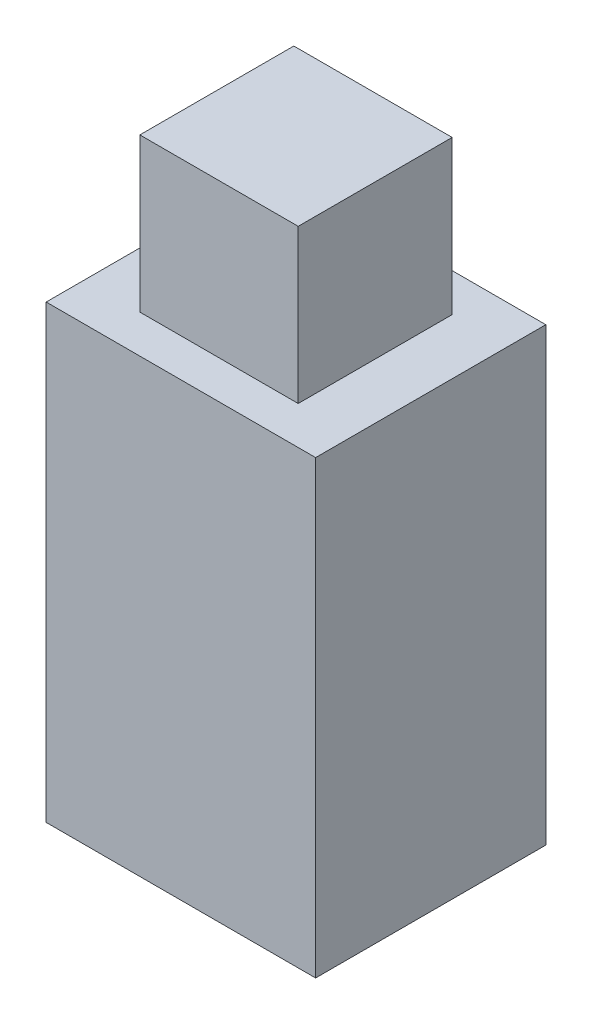
ISO-10303-21;
HEADER;
FILE_DESCRIPTION(('STEP AP214'),'2;1');
FILE_NAME('part.step','',(''),(''),'','','');
FILE_SCHEMA(('AUTOMOTIVE_DESIGN { 1 0 10303 214 1 1 1 1 }'));
ENDSEC;
DATA;
#1=APPLICATION_CONTEXT('core data for automotive mechanical design processes');
#2=APPLICATION_PROTOCOL_DEFINITION('international standard','automotive_design',2000,#1);
#3=PRODUCT_CONTEXT('',#1,'mechanical');
#4=PRODUCT('Part','Part','',(#3));
#5=PRODUCT_RELATED_PRODUCT_CATEGORY('part','',(#4));
#6=PRODUCT_DEFINITION_FORMATION('','',#4);
#7=PRODUCT_DEFINITION_CONTEXT('part definition',#1,'design');
#8=PRODUCT_DEFINITION('design','',#6,#7);
#9=PRODUCT_DEFINITION_SHAPE('','',#8);
#10=(LENGTH_UNIT() NAMED_UNIT(*) SI_UNIT(.MILLI.,.METRE.));
#11=(NAMED_UNIT(*) PLANE_ANGLE_UNIT() SI_UNIT($,.RADIAN.));
#12=(NAMED_UNIT(*) SI_UNIT($,.STERADIAN.) SOLID_ANGLE_UNIT());
#13=UNCERTAINTY_MEASURE_WITH_UNIT(LENGTH_MEASURE(1.E-05),#10,'distance_accuracy_value','');
#14=(GEOMETRIC_REPRESENTATION_CONTEXT(3) GLOBAL_UNCERTAINTY_ASSIGNED_CONTEXT((#13)) GLOBAL_UNIT_ASSIGNED_CONTEXT((#10,
#11,#12)) REPRESENTATION_CONTEXT('',''));
#15=CARTESIAN_POINT('',(0.,0.,0.));
#16=DIRECTION('',(0.,0.,1.));
#17=DIRECTION('',(1.,0.,0.));
#18=AXIS2_PLACEMENT_3D('',#15,#16,#17);
#19=CARTESIAN_POINT('',(-51.5518004325486,45.6166880918545,60.));
#20=DIRECTION('',(0.,-1.,0.));
#21=DIRECTION('',(0.,0.,-1.));
#22=AXIS2_PLACEMENT_3D('',#19,#20,#21);
#23=PLANE('',#22);
#24=DIRECTION('',(-1.,0.,0.));
#25=VECTOR('',#24,1.);
#26=CARTESIAN_POINT('',(-51.5518004325486,45.6166880918545,0.));
#27=LINE('',#26,#25);
#28=CARTESIAN_POINT('',(18.6789460491354,45.6166880918545,0.));
#29=VERTEX_POINT('',#28);
#30=CARTESIAN_POINT('',(-51.5518004325486,45.6166880918545,0.));
#31=VERTEX_POINT('',#30);
#32=EDGE_CURVE('E121',#29,#31,#27,.T.);
#33=ORIENTED_EDGE('',*,*,#32,.T.);
#34=DIRECTION('',(0.,0.,-1.));
#35=VECTOR('',#34,1.);
#36=CARTESIAN_POINT('',(-51.5518004325486,45.6166880918545,60.));
#37=LINE('',#36,#35);
#38=CARTESIAN_POINT('',(-51.5518004325486,45.6166880918545,60.));
#39=VERTEX_POINT('',#38);
#40=EDGE_CURVE('E41',#39,#31,#37,.T.);
#41=ORIENTED_EDGE('',*,*,#40,.F.);
#42=DIRECTION('',(-1.,0.,0.));
#43=VECTOR('',#42,1.);
#44=CARTESIAN_POINT('',(-51.5518004325486,45.6166880918545,60.));
#45=LINE('',#44,#43);
#46=CARTESIAN_POINT('',(18.6789460491354,45.6166880918545,60.));
#47=VERTEX_POINT('',#46);
#48=EDGE_CURVE('E130',#47,#39,#45,.T.);
#49=ORIENTED_EDGE('',*,*,#48,.F.);
#50=DIRECTION('',(0.,0.,-1.));
#51=VECTOR('',#50,1.);
#52=CARTESIAN_POINT('',(18.6789460491354,45.6166880918545,60.));
#53=LINE('',#52,#51);
#54=EDGE_CURVE('E11',#47,#29,#53,.T.);
#55=ORIENTED_EDGE('',*,*,#54,.T.);
#56=EDGE_LOOP('',(#33,#41,#49,#55));
#57=FACE_BOUND('',#56,.T.);
#58=DIRECTION('',(0.,0.,1.));
#59=VECTOR('',#58,1.);
#60=CARTESIAN_POINT('',(-37.072848430455,45.6166880918545,50.0657033429638));
#61=LINE('',#60,#59);
#62=CARTESIAN_POINT('',(-37.072848430455,45.6166880918545,9.93429665703616));
#63=VERTEX_POINT('',#62);
#64=CARTESIAN_POINT('',(-37.072848430455,45.6166880918545,50.0657033429638));
#65=VERTEX_POINT('',#64);
#66=EDGE_CURVE('E48',#63,#65,#61,.T.);
#67=ORIENTED_EDGE('',*,*,#66,.F.);
#68=DIRECTION('',(-1.,0.,0.));
#69=VECTOR('',#68,1.);
#70=CARTESIAN_POINT('',(4.19999404704186,45.6166880918545,9.93429665703616));
#71=LINE('',#70,#69);
#72=CARTESIAN_POINT('',(4.19999404704186,45.6166880918545,9.93429665703616));
#73=VERTEX_POINT('',#72);
#74=EDGE_CURVE('E52',#73,#63,#71,.T.);
#75=ORIENTED_EDGE('',*,*,#74,.F.);
#76=DIRECTION('',(0.,0.,-1.));
#77=VECTOR('',#76,1.);
#78=CARTESIAN_POINT('',(4.19999404704186,45.6166880918545,50.0657033429638));
#79=LINE('',#78,#77);
#80=CARTESIAN_POINT('',(4.19999404704186,45.6166880918545,50.0657033429638));
#81=VERTEX_POINT('',#80);
#82=EDGE_CURVE('E260',#81,#73,#79,.T.);
#83=ORIENTED_EDGE('',*,*,#82,.F.);
#84=DIRECTION('',(1.,0.,0.));
#85=VECTOR('',#84,1.);
#86=CARTESIAN_POINT('',(4.19999404704186,45.6166880918545,50.0657033429638));
#87=LINE('',#86,#85);
#88=EDGE_CURVE('E266',#65,#81,#87,.T.);
#89=ORIENTED_EDGE('',*,*,#88,.F.);
#90=EDGE_LOOP('',(#67,#75,#83,#89));
#91=FACE_BOUND('',#90,.T.);
#92=ADVANCED_FACE('F33',(#57,#91),#23,.F.);
#93=CARTESIAN_POINT('',(18.6789460491354,-71.8594149399223,60.));
#94=DIRECTION('',(-1.,0.,0.));
#95=DIRECTION('',(0.,0.,1.));
#96=AXIS2_PLACEMENT_3D('',#93,#94,#95);
#97=PLANE('',#96);
#98=DIRECTION('',(0.,1.,0.));
#99=VECTOR('',#98,1.);
#100=CARTESIAN_POINT('',(18.6789460491354,-71.8594149399223,0.));
#101=LINE('',#100,#99);
#102=CARTESIAN_POINT('',(18.6789460491354,-71.8594149399223,0.));
#103=VERTEX_POINT('',#102);
#104=EDGE_CURVE('E118',#103,#29,#101,.T.);
#105=ORIENTED_EDGE('',*,*,#104,.T.);
#106=ORIENTED_EDGE('',*,*,#54,.F.);
#107=DIRECTION('',(0.,1.,0.));
#108=VECTOR('',#107,1.);
#109=CARTESIAN_POINT('',(18.6789460491354,-71.8594149399223,60.));
#110=LINE('',#109,#108);
#111=CARTESIAN_POINT('',(18.6789460491354,-71.8594149399223,60.));
#112=VERTEX_POINT('',#111);
#113=EDGE_CURVE('E127',#112,#47,#110,.T.);
#114=ORIENTED_EDGE('',*,*,#113,.F.);
#115=DIRECTION('',(0.,0.,-1.));
#116=VECTOR('',#115,1.);
#117=CARTESIAN_POINT('',(18.6789460491354,-71.8594149399223,60.));
#118=LINE('',#117,#116);
#119=EDGE_CURVE('E136',#112,#103,#118,.T.);
#120=ORIENTED_EDGE('',*,*,#119,.T.);
#121=EDGE_LOOP('',(#105,#106,#114,#120));
#122=FACE_BOUND('',#121,.T.);
#123=ADVANCED_FACE('F35',(#122),#97,.F.);
#124=CARTESIAN_POINT('',(-51.5518004325486,-71.8594149399223,60.));
#125=DIRECTION('',(1.,0.,0.));
#126=DIRECTION('',(0.,0.,-1.));
#127=AXIS2_PLACEMENT_3D('',#124,#125,#126);
#128=PLANE('',#127);
#129=DIRECTION('',(0.,-1.,0.));
#130=VECTOR('',#129,1.);
#131=CARTESIAN_POINT('',(-51.5518004325486,-71.8594149399223,0.));
#132=LINE('',#131,#130);
#133=CARTESIAN_POINT('',(-51.5518004325486,-71.8594149399223,0.));
#134=VERTEX_POINT('',#133);
#135=EDGE_CURVE('E139',#31,#134,#132,.T.);
#136=ORIENTED_EDGE('',*,*,#135,.T.);
#137=DIRECTION('',(0.,0.,-1.));
#138=VECTOR('',#137,1.);
#139=CARTESIAN_POINT('',(-51.5518004325486,-71.8594149399223,60.));
#140=LINE('',#139,#138);
#141=CARTESIAN_POINT('',(-51.5518004325486,-71.8594149399223,60.));
#142=VERTEX_POINT('',#141);
#143=EDGE_CURVE('E144',#142,#134,#140,.T.);
#144=ORIENTED_EDGE('',*,*,#143,.F.);
#145=DIRECTION('',(0.,-1.,0.));
#146=VECTOR('',#145,1.);
#147=CARTESIAN_POINT('',(-51.5518004325486,-71.8594149399223,60.));
#148=LINE('',#147,#146);
#149=EDGE_CURVE('E133',#39,#142,#148,.T.);
#150=ORIENTED_EDGE('',*,*,#149,.F.);
#151=ORIENTED_EDGE('',*,*,#40,.T.);
#152=EDGE_LOOP('',(#136,#144,#150,#151));
#153=FACE_BOUND('',#152,.T.);
#154=ADVANCED_FACE('F151',(#153),#128,.F.);
#155=CARTESIAN_POINT('',(-51.5518004325486,-71.8594149399223,60.));
#156=DIRECTION('',(0.,1.,0.));
#157=DIRECTION('',(0.,0.,1.));
#158=AXIS2_PLACEMENT_3D('',#155,#156,#157);
#159=PLANE('',#158);
#160=DIRECTION('',(1.,0.,0.));
#161=VECTOR('',#160,1.);
#162=CARTESIAN_POINT('',(-51.5518004325486,-71.8594149399223,0.));
#163=LINE('',#162,#161);
#164=EDGE_CURVE('E131',#134,#103,#163,.T.);
#165=ORIENTED_EDGE('',*,*,#164,.T.);
#166=ORIENTED_EDGE('',*,*,#119,.F.);
#167=DIRECTION('',(1.,0.,0.));
#168=VECTOR('',#167,1.);
#169=CARTESIAN_POINT('',(-51.5518004325486,-71.8594149399223,60.));
#170=LINE('',#169,#168);
#171=EDGE_CURVE('E135',#142,#112,#170,.T.);
#172=ORIENTED_EDGE('',*,*,#171,.F.);
#173=ORIENTED_EDGE('',*,*,#143,.T.);
#174=EDGE_LOOP('',(#165,#166,#172,#173));
#175=FACE_BOUND('',#174,.T.);
#176=ADVANCED_FACE('F160',(#175),#159,.F.);
#177=CARTESIAN_POINT('',(0.,0.,60.));
#178=DIRECTION('',(0.,0.,-1.));
#179=DIRECTION('',(-1.,0.,0.));
#180=AXIS2_PLACEMENT_3D('',#177,#178,#179);
#181=PLANE('',#180);
#182=ORIENTED_EDGE('',*,*,#113,.T.);
#183=ORIENTED_EDGE('',*,*,#48,.T.);
#184=ORIENTED_EDGE('',*,*,#149,.T.);
#185=ORIENTED_EDGE('',*,*,#171,.T.);
#186=EDGE_LOOP('',(#182,#183,#184,#185));
#187=FACE_BOUND('',#186,.T.);
#188=ADVANCED_FACE('F166',(#187),#181,.F.);
#189=CARTESIAN_POINT('',(0.,0.,0.));
#190=DIRECTION('',(0.,0.,-1.));
#191=DIRECTION('',(-1.,0.,0.));
#192=AXIS2_PLACEMENT_3D('',#189,#190,#191);
#193=PLANE('',#192);
#194=ORIENTED_EDGE('',*,*,#104,.F.);
#195=ORIENTED_EDGE('',*,*,#164,.F.);
#196=ORIENTED_EDGE('',*,*,#135,.F.);
#197=ORIENTED_EDGE('',*,*,#32,.F.);
#198=EDGE_LOOP('',(#194,#195,#196,#197));
#199=FACE_BOUND('',#198,.T.);
#200=ADVANCED_FACE('F157',(#199),#193,.T.);
#201=CARTESIAN_POINT('',(-37.072848430455,85.6166880918545,50.0657033429638));
#202=DIRECTION('',(1.,0.,0.));
#203=DIRECTION('',(0.,0.,-1.));
#204=AXIS2_PLACEMENT_3D('',#201,#202,#203);
#205=PLANE('',#204);
#206=ORIENTED_EDGE('',*,*,#66,.T.);
#207=DIRECTION('',(0.,-1.,0.));
#208=VECTOR('',#207,1.);
#209=CARTESIAN_POINT('',(-37.072848430455,85.6166880918545,50.0657033429638));
#210=LINE('',#209,#208);
#211=CARTESIAN_POINT('',(-37.072848430455,85.6166880918545,50.0657033429638));
#212=VERTEX_POINT('',#211);
#213=EDGE_CURVE('E101',#212,#65,#210,.T.);
#214=ORIENTED_EDGE('',*,*,#213,.F.);
#215=DIRECTION('',(0.,0.,1.));
#216=VECTOR('',#215,1.);
#217=CARTESIAN_POINT('',(-37.072848430455,85.6166880918545,50.0657033429638));
#218=LINE('',#217,#216);
#219=CARTESIAN_POINT('',(-37.072848430455,85.6166880918545,9.93429665703616));
#220=VERTEX_POINT('',#219);
#221=EDGE_CURVE('E107',#220,#212,#218,.T.);
#222=ORIENTED_EDGE('',*,*,#221,.F.);
#223=DIRECTION('',(0.,-1.,0.));
#224=VECTOR('',#223,1.);
#225=CARTESIAN_POINT('',(-37.072848430455,85.6166880918545,9.93429665703616));
#226=LINE('',#225,#224);
#227=EDGE_CURVE('E258',#220,#63,#226,.T.);
#228=ORIENTED_EDGE('',*,*,#227,.T.);
#229=EDGE_LOOP('',(#206,#214,#222,#228));
#230=FACE_BOUND('',#229,.T.);
#231=ADVANCED_FACE('F117',(#230),#205,.F.);
#232=CARTESIAN_POINT('',(4.19999404704186,85.6166880918545,50.0657033429638));
#233=DIRECTION('',(0.,0.,-1.));
#234=DIRECTION('',(-1.,0.,0.));
#235=AXIS2_PLACEMENT_3D('',#232,#233,#234);
#236=PLANE('',#235);
#237=ORIENTED_EDGE('',*,*,#88,.T.);
#238=DIRECTION('',(0.,-1.,0.));
#239=VECTOR('',#238,1.);
#240=CARTESIAN_POINT('',(4.19999404704186,85.6166880918545,50.0657033429638));
#241=LINE('',#240,#239);
#242=CARTESIAN_POINT('',(4.19999404704186,85.6166880918545,50.0657033429638));
#243=VERTEX_POINT('',#242);
#244=EDGE_CURVE('E103',#243,#81,#241,.T.);
#245=ORIENTED_EDGE('',*,*,#244,.F.);
#246=DIRECTION('',(1.,0.,0.));
#247=VECTOR('',#246,1.);
#248=CARTESIAN_POINT('',(4.19999404704186,85.6166880918545,50.0657033429638));
#249=LINE('',#248,#247);
#250=EDGE_CURVE('E96',#212,#243,#249,.T.);
#251=ORIENTED_EDGE('',*,*,#250,.F.);
#252=ORIENTED_EDGE('',*,*,#213,.T.);
#253=EDGE_LOOP('',(#237,#245,#251,#252));
#254=FACE_BOUND('',#253,.T.);
#255=ADVANCED_FACE('F99',(#254),#236,.F.);
#256=CARTESIAN_POINT('',(4.19999404704186,85.6166880918545,50.0657033429638));
#257=DIRECTION('',(-1.,0.,0.));
#258=DIRECTION('',(0.,0.,1.));
#259=AXIS2_PLACEMENT_3D('',#256,#257,#258);
#260=PLANE('',#259);
#261=ORIENTED_EDGE('',*,*,#82,.T.);
#262=DIRECTION('',(0.,-1.,0.));
#263=VECTOR('',#262,1.);
#264=CARTESIAN_POINT('',(4.19999404704186,85.6166880918545,9.93429665703616));
#265=LINE('',#264,#263);
#266=CARTESIAN_POINT('',(4.19999404704186,85.6166880918545,9.93429665703616));
#267=VERTEX_POINT('',#266);
#268=EDGE_CURVE('E123',#267,#73,#265,.T.);
#269=ORIENTED_EDGE('',*,*,#268,.F.);
#270=DIRECTION('',(0.,0.,-1.));
#271=VECTOR('',#270,1.);
#272=CARTESIAN_POINT('',(4.19999404704186,85.6166880918545,50.0657033429638));
#273=LINE('',#272,#271);
#274=EDGE_CURVE('E106',#243,#267,#273,.T.);
#275=ORIENTED_EDGE('',*,*,#274,.F.);
#276=ORIENTED_EDGE('',*,*,#244,.T.);
#277=EDGE_LOOP('',(#261,#269,#275,#276));
#278=FACE_BOUND('',#277,.T.);
#279=ADVANCED_FACE('F184',(#278),#260,.F.);
#280=CARTESIAN_POINT('',(4.19999404704186,85.6166880918545,9.93429665703616));
#281=DIRECTION('',(0.,0.,1.));
#282=DIRECTION('',(1.,0.,0.));
#283=AXIS2_PLACEMENT_3D('',#280,#281,#282);
#284=PLANE('',#283);
#285=ORIENTED_EDGE('',*,*,#74,.T.);
#286=ORIENTED_EDGE('',*,*,#227,.F.);
#287=DIRECTION('',(-1.,0.,0.));
#288=VECTOR('',#287,1.);
#289=CARTESIAN_POINT('',(4.19999404704186,85.6166880918545,9.93429665703616));
#290=LINE('',#289,#288);
#291=EDGE_CURVE('E112',#267,#220,#290,.T.);
#292=ORIENTED_EDGE('',*,*,#291,.F.);
#293=ORIENTED_EDGE('',*,*,#268,.T.);
#294=EDGE_LOOP('',(#285,#286,#292,#293));
#295=FACE_BOUND('',#294,.T.);
#296=ADVANCED_FACE('F187',(#295),#284,.F.);
#297=CARTESIAN_POINT('',(0.,85.6166880918545,0.));
#298=DIRECTION('',(0.,1.,0.));
#299=DIRECTION('',(0.,0.,1.));
#300=AXIS2_PLACEMENT_3D('',#297,#298,#299);
#301=PLANE('',#300);
#302=ORIENTED_EDGE('',*,*,#221,.T.);
#303=ORIENTED_EDGE('',*,*,#250,.T.);
#304=ORIENTED_EDGE('',*,*,#274,.T.);
#305=ORIENTED_EDGE('',*,*,#291,.T.);
#306=EDGE_LOOP('',(#302,#303,#304,#305));
#307=FACE_BOUND('',#306,.T.);
#308=ADVANCED_FACE('F110',(#307),#301,.T.);
#309=CLOSED_SHELL('',(#92,#123,#154,#176,#188,#200,#231,#255,#279,#296,#308));
#310=MANIFOLD_SOLID_BREP('B2',#309);
#311=ADVANCED_BREP_SHAPE_REPRESENTATION('',(#18,#310),#14);
#312=SHAPE_DEFINITION_REPRESENTATION(#9,#311);
ENDSEC;
END-ISO-10303-21;
